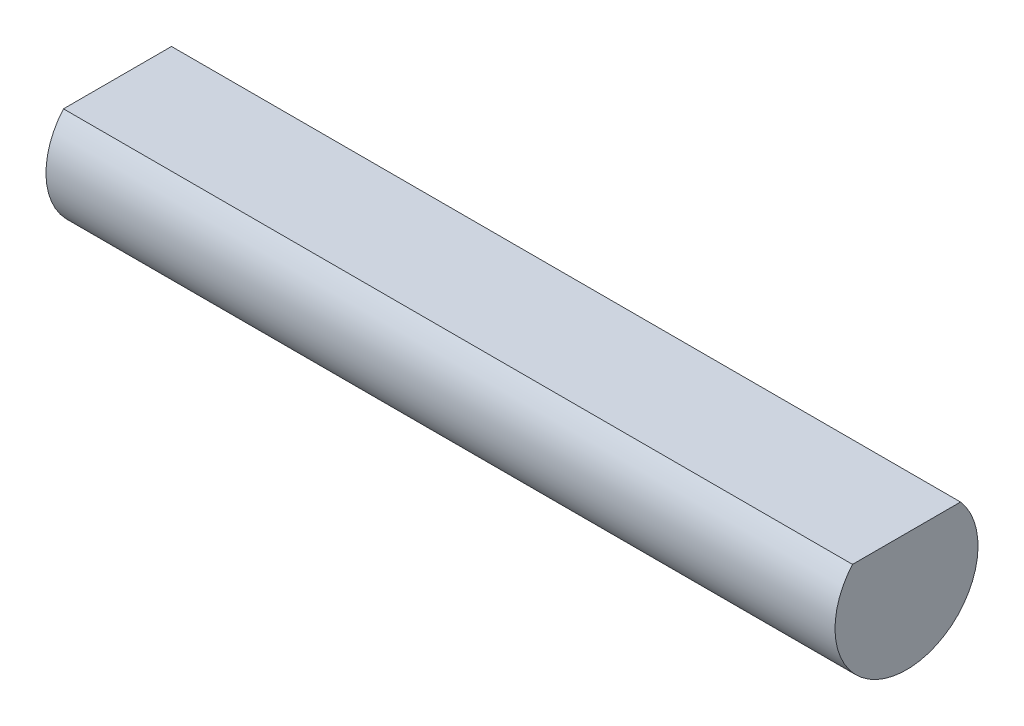
ISO-10303-21;
HEADER;
FILE_DESCRIPTION(('STEP AP214'),'2;1');
FILE_NAME('part.step','',(''),(''),'','','');
FILE_SCHEMA(('AUTOMOTIVE_DESIGN { 1 0 10303 214 1 1 1 1 }'));
ENDSEC;
DATA;
#1=APPLICATION_CONTEXT('core data for automotive mechanical design processes');
#2=APPLICATION_PROTOCOL_DEFINITION('international standard','automotive_design',2000,#1);
#3=PRODUCT_CONTEXT('',#1,'mechanical');
#4=PRODUCT('Part','Part','',(#3));
#5=PRODUCT_RELATED_PRODUCT_CATEGORY('part','',(#4));
#6=PRODUCT_DEFINITION_FORMATION('','',#4);
#7=PRODUCT_DEFINITION_CONTEXT('part definition',#1,'design');
#8=PRODUCT_DEFINITION('design','',#6,#7);
#9=PRODUCT_DEFINITION_SHAPE('','',#8);
#10=(LENGTH_UNIT() NAMED_UNIT(*) SI_UNIT(.MILLI.,.METRE.));
#11=(NAMED_UNIT(*) PLANE_ANGLE_UNIT() SI_UNIT($,.RADIAN.));
#12=(NAMED_UNIT(*) SI_UNIT($,.STERADIAN.) SOLID_ANGLE_UNIT());
#13=UNCERTAINTY_MEASURE_WITH_UNIT(LENGTH_MEASURE(1.E-05),#10,'distance_accuracy_value','');
#14=(GEOMETRIC_REPRESENTATION_CONTEXT(3) GLOBAL_UNCERTAINTY_ASSIGNED_CONTEXT((#13)) GLOBAL_UNIT_ASSIGNED_CONTEXT((#10,
#11,#12)) REPRESENTATION_CONTEXT('',''));
#15=CARTESIAN_POINT('',(0.,0.,0.));
#16=DIRECTION('',(0.,0.,1.));
#17=DIRECTION('',(1.,0.,0.));
#18=AXIS2_PLACEMENT_3D('',#15,#16,#17);
#19=CARTESIAN_POINT('',(-8.,0.95,0.));
#20=DIRECTION('',(0.,-1.,0.));
#21=DIRECTION('',(0.,0.,-1.));
#22=AXIS2_PLACEMENT_3D('',#19,#20,#21);
#23=PLANE('',#22);
#24=DIRECTION('',(1.,0.,0.));
#25=VECTOR('',#24,1.);
#26=CARTESIAN_POINT('',(-8.,0.95,1.09544511501033));
#27=LINE('',#26,#25);
#28=CARTESIAN_POINT('',(-8.,0.95,1.09544511501033));
#29=VERTEX_POINT('',#28);
#30=CARTESIAN_POINT('',(8.,0.95,1.09544511501033));
#31=VERTEX_POINT('',#30);
#32=EDGE_CURVE('E44',#29,#31,#27,.T.);
#33=ORIENTED_EDGE('',*,*,#32,.T.);
#34=DIRECTION('',(0.,0.,-1.));
#35=VECTOR('',#34,1.);
#36=CARTESIAN_POINT('',(8.,0.95,0.));
#37=LINE('',#36,#35);
#38=CARTESIAN_POINT('',(8.,0.95,-1.09544511501033));
#39=VERTEX_POINT('',#38);
#40=EDGE_CURVE('E69',#31,#39,#37,.T.);
#41=ORIENTED_EDGE('',*,*,#40,.T.);
#42=DIRECTION('',(1.,0.,0.));
#43=VECTOR('',#42,1.);
#44=CARTESIAN_POINT('',(-8.,0.95,-1.09544511501033));
#45=LINE('',#44,#43);
#46=CARTESIAN_POINT('',(-8.,0.95,-1.09544511501033));
#47=VERTEX_POINT('',#46);
#48=EDGE_CURVE('E11',#47,#39,#45,.T.);
#49=ORIENTED_EDGE('',*,*,#48,.F.);
#50=DIRECTION('',(0.,0.,-1.));
#51=VECTOR('',#50,1.);
#52=CARTESIAN_POINT('',(-8.,0.95,0.));
#53=LINE('',#52,#51);
#54=EDGE_CURVE('E55',#29,#47,#53,.T.);
#55=ORIENTED_EDGE('',*,*,#54,.F.);
#56=EDGE_LOOP('',(#33,#41,#49,#55));
#57=FACE_BOUND('',#56,.T.);
#58=ADVANCED_FACE('F41',(#57),#23,.F.);
#59=CARTESIAN_POINT('',(-8.,0.,0.));
#60=DIRECTION('',(1.,0.,0.));
#61=DIRECTION('',(0.,0.,-1.));
#62=AXIS2_PLACEMENT_3D('',#59,#60,#61);
#63=CYLINDRICAL_SURFACE('',#62,1.45);
#64=ORIENTED_EDGE('',*,*,#48,.T.);
#65=CARTESIAN_POINT('',(8.,0.,0.));
#66=DIRECTION('',(1.,0.,0.));
#67=DIRECTION('',(0.,0.,-1.));
#68=AXIS2_PLACEMENT_3D('',#65,#66,#67);
#69=CIRCLE('',#68,1.45);
#70=EDGE_CURVE('E73',#31,#39,#69,.T.);
#71=ORIENTED_EDGE('',*,*,#70,.F.);
#72=ORIENTED_EDGE('',*,*,#32,.F.);
#73=CARTESIAN_POINT('',(-8.,0.,0.));
#74=DIRECTION('',(1.,0.,0.));
#75=DIRECTION('',(0.,0.,-1.));
#76=AXIS2_PLACEMENT_3D('',#73,#74,#75);
#77=CIRCLE('',#76,1.45);
#78=EDGE_CURVE('E71',#29,#47,#77,.T.);
#79=ORIENTED_EDGE('',*,*,#78,.T.);
#80=EDGE_LOOP('',(#64,#71,#72,#79));
#81=FACE_BOUND('',#80,.T.);
#82=ADVANCED_FACE('F74',(#81),#63,.T.);
#83=CARTESIAN_POINT('',(-8.,0.,0.));
#84=DIRECTION('',(1.,0.,0.));
#85=DIRECTION('',(0.,0.,-1.));
#86=AXIS2_PLACEMENT_3D('',#83,#84,#85);
#87=PLANE('',#86);
#88=ORIENTED_EDGE('',*,*,#54,.T.);
#89=ORIENTED_EDGE('',*,*,#78,.F.);
#90=EDGE_LOOP('',(#88,#89));
#91=FACE_BOUND('',#90,.T.);
#92=ADVANCED_FACE('F85',(#91),#87,.F.);
#93=CARTESIAN_POINT('',(8.,0.,0.));
#94=DIRECTION('',(1.,0.,0.));
#95=DIRECTION('',(0.,0.,-1.));
#96=AXIS2_PLACEMENT_3D('',#93,#94,#95);
#97=PLANE('',#96);
#98=ORIENTED_EDGE('',*,*,#40,.F.);
#99=ORIENTED_EDGE('',*,*,#70,.T.);
#100=EDGE_LOOP('',(#98,#99));
#101=FACE_BOUND('',#100,.T.);
#102=ADVANCED_FACE('F78',(#101),#97,.T.);
#103=CLOSED_SHELL('',(#58,#82,#92,#102));
#104=MANIFOLD_SOLID_BREP('B2',#103);
#105=ADVANCED_BREP_SHAPE_REPRESENTATION('',(#18,#104),#14);
#106=SHAPE_DEFINITION_REPRESENTATION(#9,#105);
ENDSEC;
END-ISO-10303-21;
